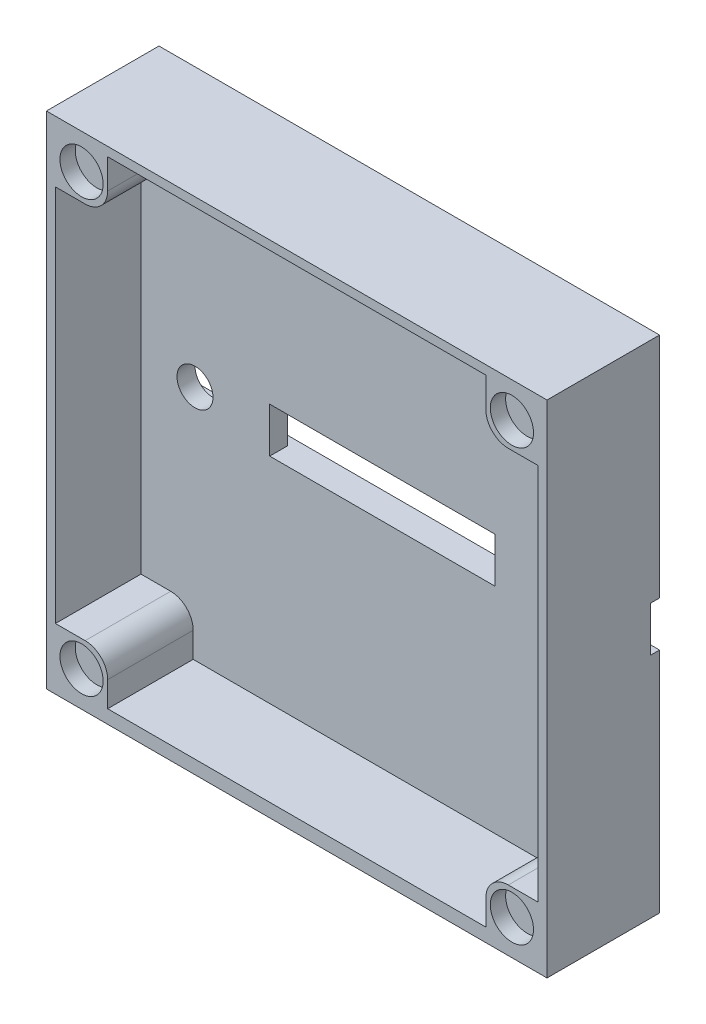
ISO-10303-21;
HEADER;
FILE_DESCRIPTION(('STEP AP214'),'2;1');
FILE_NAME('part.step','',(''),(''),'','','');
FILE_SCHEMA(('AUTOMOTIVE_DESIGN { 1 0 10303 214 1 1 1 1 }'));
ENDSEC;
DATA;
#1=APPLICATION_CONTEXT('core data for automotive mechanical design processes');
#2=APPLICATION_PROTOCOL_DEFINITION('international standard','automotive_design',2000,#1);
#3=PRODUCT_CONTEXT('',#1,'mechanical');
#4=PRODUCT('Part','Part','',(#3));
#5=PRODUCT_RELATED_PRODUCT_CATEGORY('part','',(#4));
#6=PRODUCT_DEFINITION_FORMATION('','',#4);
#7=PRODUCT_DEFINITION_CONTEXT('part definition',#1,'design');
#8=PRODUCT_DEFINITION('design','',#6,#7);
#9=PRODUCT_DEFINITION_SHAPE('','',#8);
#10=(LENGTH_UNIT() NAMED_UNIT(*) SI_UNIT(.MILLI.,.METRE.));
#11=(NAMED_UNIT(*) PLANE_ANGLE_UNIT() SI_UNIT($,.RADIAN.));
#12=(NAMED_UNIT(*) SI_UNIT($,.STERADIAN.) SOLID_ANGLE_UNIT());
#13=UNCERTAINTY_MEASURE_WITH_UNIT(LENGTH_MEASURE(1.E-05),#10,'distance_accuracy_value','');
#14=(GEOMETRIC_REPRESENTATION_CONTEXT(3) GLOBAL_UNCERTAINTY_ASSIGNED_CONTEXT((#13)) GLOBAL_UNIT_ASSIGNED_CONTEXT((#10,
#11,#12)) REPRESENTATION_CONTEXT('',''));
#15=CARTESIAN_POINT('',(0.,0.,0.));
#16=DIRECTION('',(0.,0.,1.));
#17=DIRECTION('',(1.,0.,0.));
#18=AXIS2_PLACEMENT_3D('',#15,#16,#17);
#19=CARTESIAN_POINT('',(0.,0.,3.));
#20=DIRECTION('',(0.,0.,1.));
#21=DIRECTION('',(1.,0.,0.));
#22=AXIS2_PLACEMENT_3D('',#19,#20,#21);
#23=PLANE('',#22);
#24=DIRECTION('',(0.,1.,0.));
#25=VECTOR('',#24,1.);
#26=CARTESIAN_POINT('',(-21.,0.,3.));
#27=LINE('',#26,#25);
#28=CARTESIAN_POINT('',(-21.,-26.3,3.));
#29=VERTEX_POINT('',#28);
#30=CARTESIAN_POINT('',(-21.,-23.5,3.));
#31=VERTEX_POINT('',#30);
#32=EDGE_CURVE('E265',#29,#31,#27,.T.);
#33=ORIENTED_EDGE('',*,*,#32,.F.);
#34=DIRECTION('',(1.,0.,0.));
#35=VECTOR('',#34,1.);
#36=CARTESIAN_POINT('',(-26.8,-26.3,3.));
#37=LINE('',#36,#35);
#38=CARTESIAN_POINT('',(21.,-26.3,3.));
#39=VERTEX_POINT('',#38);
#40=EDGE_CURVE('E279',#29,#39,#37,.T.);
#41=ORIENTED_EDGE('',*,*,#40,.T.);
#42=DIRECTION('',(0.,-1.,0.));
#43=VECTOR('',#42,1.);
#44=CARTESIAN_POINT('',(21.,0.,3.));
#45=LINE('',#44,#43);
#46=CARTESIAN_POINT('',(21.,-23.5,3.));
#47=VERTEX_POINT('',#46);
#48=EDGE_CURVE('E347',#47,#39,#45,.T.);
#49=ORIENTED_EDGE('',*,*,#48,.F.);
#50=CARTESIAN_POINT('',(23.5,-23.5,3.));
#51=DIRECTION('',(0.,0.,1.));
#52=DIRECTION('',(1.,0.,0.));
#53=AXIS2_PLACEMENT_3D('',#50,#51,#52);
#54=CIRCLE('',#53,2.5);
#55=CARTESIAN_POINT('',(23.5,-21.,3.));
#56=VERTEX_POINT('',#55);
#57=EDGE_CURVE('E318',#47,#56,#54,.F.);
#58=ORIENTED_EDGE('',*,*,#57,.T.);
#59=DIRECTION('',(-1.,0.,0.));
#60=VECTOR('',#59,1.);
#61=CARTESIAN_POINT('',(0.,-21.,3.));
#62=LINE('',#61,#60);
#63=CARTESIAN_POINT('',(26.8,-21.,3.));
#64=VERTEX_POINT('',#63);
#65=EDGE_CURVE('E352',#64,#56,#62,.T.);
#66=ORIENTED_EDGE('',*,*,#65,.F.);
#67=DIRECTION('',(0.,-1.,0.));
#68=VECTOR('',#67,1.);
#69=CARTESIAN_POINT('',(26.8,0.,3.));
#70=LINE('',#69,#68);
#71=CARTESIAN_POINT('',(26.8,21.,3.));
#72=VERTEX_POINT('',#71);
#73=EDGE_CURVE('E416',#72,#64,#70,.T.);
#74=ORIENTED_EDGE('',*,*,#73,.F.);
#75=DIRECTION('',(1.,0.,0.));
#76=VECTOR('',#75,1.);
#77=CARTESIAN_POINT('',(0.,21.,3.));
#78=LINE('',#77,#76);
#79=CARTESIAN_POINT('',(23.5,21.,3.));
#80=VERTEX_POINT('',#79);
#81=EDGE_CURVE('E377',#80,#72,#78,.T.);
#82=ORIENTED_EDGE('',*,*,#81,.F.);
#83=CARTESIAN_POINT('',(23.5,23.5,3.));
#84=DIRECTION('',(0.,0.,1.));
#85=DIRECTION('',(1.,0.,0.));
#86=AXIS2_PLACEMENT_3D('',#83,#84,#85);
#87=CIRCLE('',#86,2.5);
#88=CARTESIAN_POINT('',(21.,23.5,3.));
#89=VERTEX_POINT('',#88);
#90=EDGE_CURVE('E316',#80,#89,#87,.F.);
#91=ORIENTED_EDGE('',*,*,#90,.T.);
#92=DIRECTION('',(0.,-1.,0.));
#93=VECTOR('',#92,1.);
#94=CARTESIAN_POINT('',(21.,0.,3.));
#95=LINE('',#94,#93);
#96=CARTESIAN_POINT('',(21.,26.8,3.));
#97=VERTEX_POINT('',#96);
#98=EDGE_CURVE('E382',#97,#89,#95,.T.);
#99=ORIENTED_EDGE('',*,*,#98,.F.);
#100=DIRECTION('',(1.,0.,0.));
#101=VECTOR('',#100,1.);
#102=CARTESIAN_POINT('',(0.,26.8,3.));
#103=LINE('',#102,#101);
#104=CARTESIAN_POINT('',(-21.,26.8,3.));
#105=VERTEX_POINT('',#104);
#106=EDGE_CURVE('E278',#105,#97,#103,.T.);
#107=ORIENTED_EDGE('',*,*,#106,.F.);
#108=DIRECTION('',(0.,1.,0.));
#109=VECTOR('',#108,1.);
#110=CARTESIAN_POINT('',(-21.,0.,3.));
#111=LINE('',#110,#109);
#112=CARTESIAN_POINT('',(-21.,23.5,3.));
#113=VERTEX_POINT('',#112);
#114=EDGE_CURVE('E363',#113,#105,#111,.T.);
#115=ORIENTED_EDGE('',*,*,#114,.F.);
#116=CARTESIAN_POINT('',(-23.5,23.5,3.));
#117=DIRECTION('',(0.,0.,1.));
#118=DIRECTION('',(1.,0.,0.));
#119=AXIS2_PLACEMENT_3D('',#116,#117,#118);
#120=CIRCLE('',#119,2.5);
#121=CARTESIAN_POINT('',(-23.5,21.,3.));
#122=VERTEX_POINT('',#121);
#123=EDGE_CURVE('E12',#113,#122,#120,.F.);
#124=ORIENTED_EDGE('',*,*,#123,.T.);
#125=DIRECTION('',(1.,0.,0.));
#126=VECTOR('',#125,1.);
#127=CARTESIAN_POINT('',(0.,21.,3.));
#128=LINE('',#127,#126);
#129=CARTESIAN_POINT('',(-26.8,21.,3.));
#130=VERTEX_POINT('',#129);
#131=EDGE_CURVE('E367',#130,#122,#128,.T.);
#132=ORIENTED_EDGE('',*,*,#131,.F.);
#133=DIRECTION('',(0.,-1.,0.));
#134=VECTOR('',#133,1.);
#135=CARTESIAN_POINT('',(-26.8,0.,3.));
#136=LINE('',#135,#134);
#137=CARTESIAN_POINT('',(-26.8,-21.,3.));
#138=VERTEX_POINT('',#137);
#139=EDGE_CURVE('E401',#130,#138,#136,.T.);
#140=ORIENTED_EDGE('',*,*,#139,.T.);
#141=DIRECTION('',(-1.,0.,0.));
#142=VECTOR('',#141,1.);
#143=CARTESIAN_POINT('',(0.,-21.,3.));
#144=LINE('',#143,#142);
#145=CARTESIAN_POINT('',(-23.5,-21.,3.));
#146=VERTEX_POINT('',#145);
#147=EDGE_CURVE('E322',#146,#138,#144,.T.);
#148=ORIENTED_EDGE('',*,*,#147,.F.);
#149=CARTESIAN_POINT('',(-23.5,-23.5,3.));
#150=DIRECTION('',(0.,0.,1.));
#151=DIRECTION('',(1.,0.,0.));
#152=AXIS2_PLACEMENT_3D('',#149,#150,#151);
#153=CIRCLE('',#152,2.5);
#154=EDGE_CURVE('E79',#146,#31,#153,.F.);
#155=ORIENTED_EDGE('',*,*,#154,.T.);
#156=EDGE_LOOP('',(#33,#41,#49,#58,#66,#74,#82,#91,#99,#107,#115,#124,#132,#140,#148,#155));
#157=FACE_BOUND('',#156,.T.);
#158=CARTESIAN_POINT('',(20.8,0.,3.));
#159=DIRECTION('',(0.,0.,1.));
#160=DIRECTION('',(1.,0.,0.));
#161=AXIS2_PLACEMENT_3D('',#158,#159,#160);
#162=CIRCLE('',#161,2.);
#163=CARTESIAN_POINT('',(22.8,0.,3.));
#164=VERTEX_POINT('',#163);
#165=EDGE_CURVE('E394',#164,#164,#162,.T.);
#166=ORIENTED_EDGE('',*,*,#165,.F.);
#167=EDGE_LOOP('',(#166));
#168=FACE_BOUND('',#167,.T.);
#169=CARTESIAN_POINT('',(-20.8,0.,3.));
#170=DIRECTION('',(0.,0.,1.));
#171=DIRECTION('',(1.,0.,0.));
#172=AXIS2_PLACEMENT_3D('',#169,#170,#171);
#173=CIRCLE('',#172,2.);
#174=CARTESIAN_POINT('',(-18.8,0.,3.));
#175=VERTEX_POINT('',#174);
#176=EDGE_CURVE('E389',#175,#175,#173,.T.);
#177=ORIENTED_EDGE('',*,*,#176,.F.);
#178=EDGE_LOOP('',(#177));
#179=FACE_BOUND('',#178,.T.);
#180=DIRECTION('',(0.,1.,0.));
#181=VECTOR('',#180,1.);
#182=CARTESIAN_POINT('',(12.5,2.5,3.));
#183=LINE('',#182,#181);
#184=CARTESIAN_POINT('',(12.5,-2.5,3.));
#185=VERTEX_POINT('',#184);
#186=CARTESIAN_POINT('',(12.5,2.5,3.));
#187=VERTEX_POINT('',#186);
#188=EDGE_CURVE('E442',#185,#187,#183,.T.);
#189=ORIENTED_EDGE('',*,*,#188,.F.);
#190=DIRECTION('',(1.,0.,0.));
#191=VECTOR('',#190,1.);
#192=CARTESIAN_POINT('',(-12.5,-2.5,3.));
#193=LINE('',#192,#191);
#194=CARTESIAN_POINT('',(-12.5,-2.5,3.));
#195=VERTEX_POINT('',#194);
#196=EDGE_CURVE('E453',#195,#185,#193,.T.);
#197=ORIENTED_EDGE('',*,*,#196,.F.);
#198=DIRECTION('',(0.,-1.,0.));
#199=VECTOR('',#198,1.);
#200=CARTESIAN_POINT('',(-12.5,2.5,3.));
#201=LINE('',#200,#199);
#202=CARTESIAN_POINT('',(-12.5,2.5,3.));
#203=VERTEX_POINT('',#202);
#204=EDGE_CURVE('E460',#203,#195,#201,.T.);
#205=ORIENTED_EDGE('',*,*,#204,.F.);
#206=DIRECTION('',(-1.,0.,0.));
#207=VECTOR('',#206,1.);
#208=CARTESIAN_POINT('',(-12.5,2.5,3.));
#209=LINE('',#208,#207);
#210=EDGE_CURVE('E457',#187,#203,#209,.T.);
#211=ORIENTED_EDGE('',*,*,#210,.F.);
#212=EDGE_LOOP('',(#189,#197,#205,#211));
#213=FACE_BOUND('',#212,.T.);
#214=ADVANCED_FACE('F71',(#157,#168,#179,#213),#23,.T.);
#215=CARTESIAN_POINT('',(27.8,27.8,3.));
#216=DIRECTION('',(1.,0.,0.));
#217=DIRECTION('',(0.,1.,0.));
#218=AXIS2_PLACEMENT_3D('',#215,#216,#217);
#219=PLANE('',#218);
#220=DIRECTION('',(0.,0.,-1.));
#221=VECTOR('',#220,1.);
#222=CARTESIAN_POINT('',(27.8,27.8,3.));
#223=LINE('',#222,#221);
#224=CARTESIAN_POINT('',(27.8,27.8,12.5));
#225=VERTEX_POINT('',#224);
#226=CARTESIAN_POINT('',(27.8,27.8,0.));
#227=VERTEX_POINT('',#226);
#228=EDGE_CURVE('E486',#225,#227,#223,.T.);
#229=ORIENTED_EDGE('',*,*,#228,.F.);
#230=DIRECTION('',(0.,1.,0.));
#231=VECTOR('',#230,1.);
#232=CARTESIAN_POINT('',(27.8,0.,12.5));
#233=LINE('',#232,#231);
#234=CARTESIAN_POINT('',(27.8,-27.8,12.5));
#235=VERTEX_POINT('',#234);
#236=EDGE_CURVE('E406',#235,#225,#233,.T.);
#237=ORIENTED_EDGE('',*,*,#236,.F.);
#238=DIRECTION('',(0.,0.,-1.));
#239=VECTOR('',#238,1.);
#240=CARTESIAN_POINT('',(27.8,-27.8,3.));
#241=LINE('',#240,#239);
#242=CARTESIAN_POINT('',(27.8,-27.8,0.));
#243=VERTEX_POINT('',#242);
#244=EDGE_CURVE('E290',#235,#243,#241,.T.);
#245=ORIENTED_EDGE('',*,*,#244,.T.);
#246=DIRECTION('',(0.,-1.,0.));
#247=VECTOR('',#246,1.);
#248=CARTESIAN_POINT('',(27.8,27.8,0.));
#249=LINE('',#248,#247);
#250=CARTESIAN_POINT('',(27.8,-2.5,0.));
#251=VERTEX_POINT('',#250);
#252=EDGE_CURVE('E480',#251,#243,#249,.T.);
#253=ORIENTED_EDGE('',*,*,#252,.F.);
#254=DIRECTION('',(0.,0.,-1.));
#255=VECTOR('',#254,1.);
#256=CARTESIAN_POINT('',(27.8,-2.5,1.));
#257=LINE('',#256,#255);
#258=CARTESIAN_POINT('',(27.8,-2.5,1.));
#259=VERTEX_POINT('',#258);
#260=EDGE_CURVE('E435',#259,#251,#257,.T.);
#261=ORIENTED_EDGE('',*,*,#260,.F.);
#262=DIRECTION('',(0.,-1.,0.));
#263=VECTOR('',#262,1.);
#264=CARTESIAN_POINT('',(27.8,2.5,1.));
#265=LINE('',#264,#263);
#266=CARTESIAN_POINT('',(27.8,2.5,1.));
#267=VERTEX_POINT('',#266);
#268=EDGE_CURVE('E421',#267,#259,#265,.T.);
#269=ORIENTED_EDGE('',*,*,#268,.F.);
#270=DIRECTION('',(0.,0.,-1.));
#271=VECTOR('',#270,1.);
#272=CARTESIAN_POINT('',(27.8,2.5,1.));
#273=LINE('',#272,#271);
#274=CARTESIAN_POINT('',(27.8,2.5,0.));
#275=VERTEX_POINT('',#274);
#276=EDGE_CURVE('E439',#267,#275,#273,.T.);
#277=ORIENTED_EDGE('',*,*,#276,.T.);
#278=EDGE_CURVE('E481',#227,#275,#249,.T.);
#279=ORIENTED_EDGE('',*,*,#278,.F.);
#280=EDGE_LOOP('',(#229,#237,#245,#253,#261,#269,#277,#279));
#281=FACE_BOUND('',#280,.T.);
#282=ADVANCED_FACE('F511',(#281),#219,.T.);
#283=CARTESIAN_POINT('',(-27.8,27.8,3.));
#284=DIRECTION('',(1.,0.,0.));
#285=DIRECTION('',(0.,1.,0.));
#286=AXIS2_PLACEMENT_3D('',#283,#284,#285);
#287=PLANE('',#286);
#288=DIRECTION('',(0.,-1.,0.));
#289=VECTOR('',#288,1.);
#290=CARTESIAN_POINT('',(-27.8,27.8,0.));
#291=LINE('',#290,#289);
#292=CARTESIAN_POINT('',(-27.8,-2.5,0.));
#293=VERTEX_POINT('',#292);
#294=CARTESIAN_POINT('',(-27.8,-27.8,0.));
#295=VERTEX_POINT('',#294);
#296=EDGE_CURVE('E475',#293,#295,#291,.T.);
#297=ORIENTED_EDGE('',*,*,#296,.T.);
#298=DIRECTION('',(0.,0.,-1.));
#299=VECTOR('',#298,1.);
#300=CARTESIAN_POINT('',(-27.8,-27.8,3.));
#301=LINE('',#300,#299);
#302=CARTESIAN_POINT('',(-27.8,-27.8,12.5));
#303=VERTEX_POINT('',#302);
#304=EDGE_CURVE('E483',#303,#295,#301,.T.);
#305=ORIENTED_EDGE('',*,*,#304,.F.);
#306=DIRECTION('',(0.,-1.,0.));
#307=VECTOR('',#306,1.);
#308=CARTESIAN_POINT('',(-27.8,0.,12.5));
#309=LINE('',#308,#307);
#310=CARTESIAN_POINT('',(-27.8,27.8,12.5));
#311=VERTEX_POINT('',#310);
#312=EDGE_CURVE('E410',#311,#303,#309,.T.);
#313=ORIENTED_EDGE('',*,*,#312,.F.);
#314=DIRECTION('',(0.,0.,-1.));
#315=VECTOR('',#314,1.);
#316=CARTESIAN_POINT('',(-27.8,27.8,3.));
#317=LINE('',#316,#315);
#318=CARTESIAN_POINT('',(-27.8,27.8,0.));
#319=VERTEX_POINT('',#318);
#320=EDGE_CURVE('E488',#311,#319,#317,.T.);
#321=ORIENTED_EDGE('',*,*,#320,.T.);
#322=CARTESIAN_POINT('',(-27.8,2.5,0.));
#323=VERTEX_POINT('',#322);
#324=EDGE_CURVE('E476',#319,#323,#291,.T.);
#325=ORIENTED_EDGE('',*,*,#324,.T.);
#326=DIRECTION('',(0.,0.,-1.));
#327=VECTOR('',#326,1.);
#328=CARTESIAN_POINT('',(-27.8,2.5,1.));
#329=LINE('',#328,#327);
#330=CARTESIAN_POINT('',(-27.8,2.5,1.));
#331=VERTEX_POINT('',#330);
#332=EDGE_CURVE('E443',#331,#323,#329,.T.);
#333=ORIENTED_EDGE('',*,*,#332,.F.);
#334=DIRECTION('',(0.,-1.,0.));
#335=VECTOR('',#334,1.);
#336=CARTESIAN_POINT('',(-27.8,2.5,1.));
#337=LINE('',#336,#335);
#338=CARTESIAN_POINT('',(-27.8,-2.5,1.));
#339=VERTEX_POINT('',#338);
#340=EDGE_CURVE('E428',#331,#339,#337,.T.);
#341=ORIENTED_EDGE('',*,*,#340,.T.);
#342=DIRECTION('',(0.,0.,-1.));
#343=VECTOR('',#342,1.);
#344=CARTESIAN_POINT('',(-27.8,-2.5,1.));
#345=LINE('',#344,#343);
#346=EDGE_CURVE('E446',#339,#293,#345,.T.);
#347=ORIENTED_EDGE('',*,*,#346,.T.);
#348=EDGE_LOOP('',(#297,#305,#313,#321,#325,#333,#341,#347));
#349=FACE_BOUND('',#348,.T.);
#350=ADVANCED_FACE('F500',(#349),#287,.F.);
#351=CARTESIAN_POINT('',(0.,0.,0.));
#352=DIRECTION('',(0.,0.,1.));
#353=DIRECTION('',(1.,0.,0.));
#354=AXIS2_PLACEMENT_3D('',#351,#352,#353);
#355=PLANE('',#354);
#356=DIRECTION('',(-1.,0.,0.));
#357=VECTOR('',#356,1.);
#358=CARTESIAN_POINT('',(27.8,2.5,0.));
#359=LINE('',#358,#357);
#360=EDGE_CURVE('E425',#275,#323,#359,.T.);
#361=ORIENTED_EDGE('',*,*,#360,.T.);
#362=ORIENTED_EDGE('',*,*,#324,.F.);
#363=DIRECTION('',(-1.,0.,0.));
#364=VECTOR('',#363,1.);
#365=CARTESIAN_POINT('',(27.8,27.8,0.));
#366=LINE('',#365,#364);
#367=EDGE_CURVE('E478',#227,#319,#366,.T.);
#368=ORIENTED_EDGE('',*,*,#367,.F.);
#369=ORIENTED_EDGE('',*,*,#278,.T.);
#370=EDGE_LOOP('',(#361,#362,#368,#369));
#371=FACE_BOUND('',#370,.T.);
#372=ADVANCED_FACE('F521',(#371),#355,.F.);
#373=CARTESIAN_POINT('',(27.8,-27.8,3.));
#374=DIRECTION('',(0.,-1.,0.));
#375=DIRECTION('',(1.,0.,0.));
#376=AXIS2_PLACEMENT_3D('',#373,#374,#375);
#377=PLANE('',#376);
#378=ORIENTED_EDGE('',*,*,#244,.F.);
#379=DIRECTION('',(1.,0.,0.));
#380=VECTOR('',#379,1.);
#381=CARTESIAN_POINT('',(0.,-27.8,12.5));
#382=LINE('',#381,#380);
#383=EDGE_CURVE('E404',#303,#235,#382,.T.);
#384=ORIENTED_EDGE('',*,*,#383,.F.);
#385=ORIENTED_EDGE('',*,*,#304,.T.);
#386=DIRECTION('',(-1.,0.,0.));
#387=VECTOR('',#386,1.);
#388=CARTESIAN_POINT('',(27.8,-27.8,0.));
#389=LINE('',#388,#387);
#390=EDGE_CURVE('E467',#243,#295,#389,.T.);
#391=ORIENTED_EDGE('',*,*,#390,.F.);
#392=EDGE_LOOP('',(#378,#384,#385,#391));
#393=FACE_BOUND('',#392,.T.);
#394=ADVANCED_FACE('F496',(#393),#377,.T.);
#395=CARTESIAN_POINT('',(27.8,27.8,3.));
#396=DIRECTION('',(0.,-1.,0.));
#397=DIRECTION('',(1.,0.,0.));
#398=AXIS2_PLACEMENT_3D('',#395,#396,#397);
#399=PLANE('',#398);
#400=ORIENTED_EDGE('',*,*,#367,.T.);
#401=ORIENTED_EDGE('',*,*,#320,.F.);
#402=DIRECTION('',(-1.,0.,0.));
#403=VECTOR('',#402,1.);
#404=CARTESIAN_POINT('',(0.,27.8,12.5));
#405=LINE('',#404,#403);
#406=EDGE_CURVE('E408',#225,#311,#405,.T.);
#407=ORIENTED_EDGE('',*,*,#406,.F.);
#408=ORIENTED_EDGE('',*,*,#228,.T.);
#409=EDGE_LOOP('',(#400,#401,#407,#408));
#410=FACE_BOUND('',#409,.T.);
#411=ADVANCED_FACE('F516',(#410),#399,.F.);
#412=ORIENTED_EDGE('',*,*,#390,.T.);
#413=ORIENTED_EDGE('',*,*,#296,.F.);
#414=DIRECTION('',(-1.,0.,0.));
#415=VECTOR('',#414,1.);
#416=CARTESIAN_POINT('',(27.8,-2.5,0.));
#417=LINE('',#416,#415);
#418=EDGE_CURVE('E414',#251,#293,#417,.T.);
#419=ORIENTED_EDGE('',*,*,#418,.F.);
#420=ORIENTED_EDGE('',*,*,#252,.T.);
#421=EDGE_LOOP('',(#412,#413,#419,#420));
#422=FACE_BOUND('',#421,.T.);
#423=ADVANCED_FACE('F505',(#422),#355,.F.);
#424=CARTESIAN_POINT('',(12.5,2.5,1.));
#425=DIRECTION('',(1.,0.,0.));
#426=DIRECTION('',(0.,0.,-1.));
#427=AXIS2_PLACEMENT_3D('',#424,#425,#426);
#428=PLANE('',#427);
#429=ORIENTED_EDGE('',*,*,#188,.T.);
#430=DIRECTION('',(0.,0.,1.));
#431=VECTOR('',#430,1.);
#432=CARTESIAN_POINT('',(12.5,2.5,1.));
#433=LINE('',#432,#431);
#434=CARTESIAN_POINT('',(12.5,2.5,1.));
#435=VERTEX_POINT('',#434);
#436=EDGE_CURVE('E455',#435,#187,#433,.T.);
#437=ORIENTED_EDGE('',*,*,#436,.F.);
#438=DIRECTION('',(0.,1.,0.));
#439=VECTOR('',#438,1.);
#440=CARTESIAN_POINT('',(12.5,2.5,1.));
#441=LINE('',#440,#439);
#442=CARTESIAN_POINT('',(12.5,-2.5,1.));
#443=VERTEX_POINT('',#442);
#444=EDGE_CURVE('E450',#443,#435,#441,.T.);
#445=ORIENTED_EDGE('',*,*,#444,.F.);
#446=DIRECTION('',(0.,0.,1.));
#447=VECTOR('',#446,1.);
#448=CARTESIAN_POINT('',(12.5,-2.5,1.));
#449=LINE('',#448,#447);
#450=EDGE_CURVE('E465',#443,#185,#449,.T.);
#451=ORIENTED_EDGE('',*,*,#450,.T.);
#452=EDGE_LOOP('',(#429,#437,#445,#451));
#453=FACE_BOUND('',#452,.T.);
#454=ADVANCED_FACE('F534',(#453),#428,.F.);
#455=CARTESIAN_POINT('',(-12.5,-2.5,1.));
#456=DIRECTION('',(0.,-1.,0.));
#457=DIRECTION('',(0.,0.,-1.));
#458=AXIS2_PLACEMENT_3D('',#455,#456,#457);
#459=PLANE('',#458);
#460=ORIENTED_EDGE('',*,*,#196,.T.);
#461=ORIENTED_EDGE('',*,*,#450,.F.);
#462=DIRECTION('',(-1.,0.,0.));
#463=VECTOR('',#462,1.);
#464=CARTESIAN_POINT('',(27.8,-2.5,1.));
#465=LINE('',#464,#463);
#466=EDGE_CURVE('E426',#259,#443,#465,.T.);
#467=ORIENTED_EDGE('',*,*,#466,.F.);
#468=ORIENTED_EDGE('',*,*,#260,.T.);
#469=ORIENTED_EDGE('',*,*,#418,.T.);
#470=ORIENTED_EDGE('',*,*,#346,.F.);
#471=CARTESIAN_POINT('',(-12.5,-2.5,1.));
#472=VERTEX_POINT('',#471);
#473=EDGE_CURVE('E424',#472,#339,#465,.T.);
#474=ORIENTED_EDGE('',*,*,#473,.F.);
#475=DIRECTION('',(0.,0.,1.));
#476=VECTOR('',#475,1.);
#477=CARTESIAN_POINT('',(-12.5,-2.5,1.));
#478=LINE('',#477,#476);
#479=EDGE_CURVE('E468',#472,#195,#478,.T.);
#480=ORIENTED_EDGE('',*,*,#479,.T.);
#481=EDGE_LOOP('',(#460,#461,#467,#468,#469,#470,#474,#480));
#482=FACE_BOUND('',#481,.T.);
#483=ADVANCED_FACE('F549',(#482),#459,.F.);
#484=CARTESIAN_POINT('',(-12.5,2.5,1.));
#485=DIRECTION('',(-1.,0.,0.));
#486=DIRECTION('',(0.,0.,1.));
#487=AXIS2_PLACEMENT_3D('',#484,#485,#486);
#488=PLANE('',#487);
#489=ORIENTED_EDGE('',*,*,#204,.T.);
#490=ORIENTED_EDGE('',*,*,#479,.F.);
#491=DIRECTION('',(0.,-1.,0.));
#492=VECTOR('',#491,1.);
#493=CARTESIAN_POINT('',(-12.5,2.5,1.));
#494=LINE('',#493,#492);
#495=CARTESIAN_POINT('',(-12.5,2.5,1.));
#496=VERTEX_POINT('',#495);
#497=EDGE_CURVE('E452',#496,#472,#494,.T.);
#498=ORIENTED_EDGE('',*,*,#497,.F.);
#499=DIRECTION('',(0.,0.,1.));
#500=VECTOR('',#499,1.);
#501=CARTESIAN_POINT('',(-12.5,2.5,1.));
#502=LINE('',#501,#500);
#503=EDGE_CURVE('E470',#496,#203,#502,.T.);
#504=ORIENTED_EDGE('',*,*,#503,.T.);
#505=EDGE_LOOP('',(#489,#490,#498,#504));
#506=FACE_BOUND('',#505,.T.);
#507=ADVANCED_FACE('F544',(#506),#488,.F.);
#508=CARTESIAN_POINT('',(-12.5,2.5,1.));
#509=DIRECTION('',(0.,1.,0.));
#510=DIRECTION('',(-1.,0.,0.));
#511=AXIS2_PLACEMENT_3D('',#508,#509,#510);
#512=PLANE('',#511);
#513=ORIENTED_EDGE('',*,*,#210,.T.);
#514=ORIENTED_EDGE('',*,*,#503,.F.);
#515=DIRECTION('',(-1.,0.,0.));
#516=VECTOR('',#515,1.);
#517=CARTESIAN_POINT('',(27.8,2.5,1.));
#518=LINE('',#517,#516);
#519=EDGE_CURVE('E431',#496,#331,#518,.T.);
#520=ORIENTED_EDGE('',*,*,#519,.T.);
#521=ORIENTED_EDGE('',*,*,#332,.T.);
#522=ORIENTED_EDGE('',*,*,#360,.F.);
#523=ORIENTED_EDGE('',*,*,#276,.F.);
#524=EDGE_CURVE('E432',#267,#435,#518,.T.);
#525=ORIENTED_EDGE('',*,*,#524,.T.);
#526=ORIENTED_EDGE('',*,*,#436,.T.);
#527=EDGE_LOOP('',(#513,#514,#520,#521,#522,#523,#525,#526));
#528=FACE_BOUND('',#527,.T.);
#529=ADVANCED_FACE('F524',(#528),#512,.F.);
#530=CARTESIAN_POINT('',(0.,0.,1.));
#531=DIRECTION('',(0.,0.,-1.));
#532=DIRECTION('',(-1.,0.,0.));
#533=AXIS2_PLACEMENT_3D('',#530,#531,#532);
#534=PLANE('',#533);
#535=CARTESIAN_POINT('',(20.8,0.,1.));
#536=DIRECTION('',(0.,0.,-1.));
#537=DIRECTION('',(-1.,0.,0.));
#538=AXIS2_PLACEMENT_3D('',#535,#536,#537);
#539=CIRCLE('',#538,2.);
#540=CARTESIAN_POINT('',(18.8,0.,1.));
#541=VERTEX_POINT('',#540);
#542=EDGE_CURVE('E386',#541,#541,#539,.T.);
#543=ORIENTED_EDGE('',*,*,#542,.F.);
#544=EDGE_LOOP('',(#543));
#545=FACE_BOUND('',#544,.T.);
#546=ORIENTED_EDGE('',*,*,#444,.T.);
#547=ORIENTED_EDGE('',*,*,#524,.F.);
#548=ORIENTED_EDGE('',*,*,#268,.T.);
#549=ORIENTED_EDGE('',*,*,#466,.T.);
#550=EDGE_LOOP('',(#546,#547,#548,#549));
#551=FACE_BOUND('',#550,.T.);
#552=ADVANCED_FACE('F528',(#545,#551),#534,.T.);
#553=CARTESIAN_POINT('',(-20.8,0.,1.));
#554=DIRECTION('',(0.,0.,-1.));
#555=DIRECTION('',(-1.,0.,0.));
#556=AXIS2_PLACEMENT_3D('',#553,#554,#555);
#557=CIRCLE('',#556,2.);
#558=CARTESIAN_POINT('',(-22.8,0.,1.));
#559=VERTEX_POINT('',#558);
#560=EDGE_CURVE('E385',#559,#559,#557,.T.);
#561=ORIENTED_EDGE('',*,*,#560,.F.);
#562=EDGE_LOOP('',(#561));
#563=FACE_BOUND('',#562,.T.);
#564=ORIENTED_EDGE('',*,*,#497,.T.);
#565=ORIENTED_EDGE('',*,*,#473,.T.);
#566=ORIENTED_EDGE('',*,*,#340,.F.);
#567=ORIENTED_EDGE('',*,*,#519,.F.);
#568=EDGE_LOOP('',(#564,#565,#566,#567));
#569=FACE_BOUND('',#568,.T.);
#570=ADVANCED_FACE('F547',(#563,#569),#534,.T.);
#571=CARTESIAN_POINT('',(26.8,0.,12.5));
#572=DIRECTION('',(1.,0.,0.));
#573=DIRECTION('',(0.,1.,0.));
#574=AXIS2_PLACEMENT_3D('',#571,#572,#573);
#575=PLANE('',#574);
#576=ORIENTED_EDGE('',*,*,#73,.T.);
#577=DIRECTION('',(0.,0.,1.));
#578=VECTOR('',#577,1.);
#579=CARTESIAN_POINT('',(26.8,-21.,12.5));
#580=LINE('',#579,#578);
#581=CARTESIAN_POINT('',(26.8,-21.,12.5));
#582=VERTEX_POINT('',#581);
#583=EDGE_CURVE('E349',#64,#582,#580,.T.);
#584=ORIENTED_EDGE('',*,*,#583,.T.);
#585=DIRECTION('',(0.,-1.,0.));
#586=VECTOR('',#585,1.);
#587=CARTESIAN_POINT('',(26.8,0.,12.5));
#588=LINE('',#587,#586);
#589=CARTESIAN_POINT('',(26.8,21.,12.5));
#590=VERTEX_POINT('',#589);
#591=EDGE_CURVE('E400',#590,#582,#588,.T.);
#592=ORIENTED_EDGE('',*,*,#591,.F.);
#593=DIRECTION('',(0.,0.,-1.));
#594=VECTOR('',#593,1.);
#595=CARTESIAN_POINT('',(26.8,21.,12.5));
#596=LINE('',#595,#594);
#597=EDGE_CURVE('E374',#590,#72,#596,.T.);
#598=ORIENTED_EDGE('',*,*,#597,.T.);
#599=EDGE_LOOP('',(#576,#584,#592,#598));
#600=FACE_BOUND('',#599,.T.);
#601=ADVANCED_FACE('F611',(#600),#575,.F.);
#602=CARTESIAN_POINT('',(-26.8,0.,12.5));
#603=DIRECTION('',(1.,0.,0.));
#604=DIRECTION('',(0.,1.,0.));
#605=AXIS2_PLACEMENT_3D('',#602,#603,#604);
#606=PLANE('',#605);
#607=DIRECTION('',(0.,0.,1.));
#608=VECTOR('',#607,1.);
#609=CARTESIAN_POINT('',(-26.8,-21.,12.5));
#610=LINE('',#609,#608);
#611=CARTESIAN_POINT('',(-26.8,-21.,12.5));
#612=VERTEX_POINT('',#611);
#613=EDGE_CURVE('E325',#138,#612,#610,.T.);
#614=ORIENTED_EDGE('',*,*,#613,.F.);
#615=ORIENTED_EDGE('',*,*,#139,.F.);
#616=DIRECTION('',(0.,0.,-1.));
#617=VECTOR('',#616,1.);
#618=CARTESIAN_POINT('',(-26.8,21.,12.5));
#619=LINE('',#618,#617);
#620=CARTESIAN_POINT('',(-26.8,21.,12.5));
#621=VERTEX_POINT('',#620);
#622=EDGE_CURVE('E365',#621,#130,#619,.T.);
#623=ORIENTED_EDGE('',*,*,#622,.F.);
#624=DIRECTION('',(0.,-1.,0.));
#625=VECTOR('',#624,1.);
#626=CARTESIAN_POINT('',(-26.8,0.,12.5));
#627=LINE('',#626,#625);
#628=EDGE_CURVE('E412',#621,#612,#627,.T.);
#629=ORIENTED_EDGE('',*,*,#628,.T.);
#630=EDGE_LOOP('',(#614,#615,#623,#629));
#631=FACE_BOUND('',#630,.T.);
#632=ADVANCED_FACE('F654',(#631),#606,.T.);
#633=CARTESIAN_POINT('',(0.,26.8,12.5));
#634=DIRECTION('',(0.,1.,0.));
#635=DIRECTION('',(0.,0.,1.));
#636=AXIS2_PLACEMENT_3D('',#633,#634,#635);
#637=PLANE('',#636);
#638=DIRECTION('',(1.,0.,0.));
#639=VECTOR('',#638,1.);
#640=CARTESIAN_POINT('',(0.,26.8,12.5));
#641=LINE('',#640,#639);
#642=CARTESIAN_POINT('',(-21.,26.8,12.5));
#643=VERTEX_POINT('',#642);
#644=CARTESIAN_POINT('',(21.,26.8,12.5));
#645=VERTEX_POINT('',#644);
#646=EDGE_CURVE('E397',#643,#645,#641,.T.);
#647=ORIENTED_EDGE('',*,*,#646,.F.);
#648=DIRECTION('',(0.,0.,-1.));
#649=VECTOR('',#648,1.);
#650=CARTESIAN_POINT('',(-21.,26.8,12.5));
#651=LINE('',#650,#649);
#652=EDGE_CURVE('E360',#643,#105,#651,.T.);
#653=ORIENTED_EDGE('',*,*,#652,.T.);
#654=ORIENTED_EDGE('',*,*,#106,.T.);
#655=DIRECTION('',(0.,0.,1.));
#656=VECTOR('',#655,1.);
#657=CARTESIAN_POINT('',(21.,26.8,12.5));
#658=LINE('',#657,#656);
#659=EDGE_CURVE('E379',#97,#645,#658,.T.);
#660=ORIENTED_EDGE('',*,*,#659,.T.);
#661=EDGE_LOOP('',(#647,#653,#654,#660));
#662=FACE_BOUND('',#661,.T.);
#663=ADVANCED_FACE('F597',(#662),#637,.F.);
#664=CARTESIAN_POINT('',(0.,0.,12.5));
#665=DIRECTION('',(0.,0.,1.));
#666=DIRECTION('',(1.,0.,0.));
#667=AXIS2_PLACEMENT_3D('',#664,#665,#666);
#668=PLANE('',#667);
#669=CARTESIAN_POINT('',(23.9002805646626,-23.9,12.5));
#670=DIRECTION('',(0.,0.,1.));
#671=DIRECTION('',(1.,0.,0.));
#672=AXIS2_PLACEMENT_3D('',#669,#670,#671);
#673=CIRCLE('',#672,2.4);
#674=CARTESIAN_POINT('',(26.3002805646626,-23.9,12.5));
#675=VERTEX_POINT('',#674);
#676=EDGE_CURVE('E1019',#675,#675,#673,.T.);
#677=ORIENTED_EDGE('',*,*,#676,.F.);
#678=EDGE_LOOP('',(#677));
#679=FACE_BOUND('',#678,.T.);
#680=CARTESIAN_POINT('',(23.9002805646626,23.9,12.5));
#681=DIRECTION('',(0.,0.,1.));
#682=DIRECTION('',(1.,0.,0.));
#683=AXIS2_PLACEMENT_3D('',#680,#681,#682);
#684=CIRCLE('',#683,2.4);
#685=CARTESIAN_POINT('',(26.3002805646626,23.9,12.5));
#686=VERTEX_POINT('',#685);
#687=EDGE_CURVE('E1013',#686,#686,#684,.T.);
#688=ORIENTED_EDGE('',*,*,#687,.F.);
#689=EDGE_LOOP('',(#688));
#690=FACE_BOUND('',#689,.T.);
#691=CARTESIAN_POINT('',(-23.9,23.9,12.5));
#692=DIRECTION('',(0.,0.,1.));
#693=DIRECTION('',(1.,0.,0.));
#694=AXIS2_PLACEMENT_3D('',#691,#692,#693);
#695=CIRCLE('',#694,2.4);
#696=CARTESIAN_POINT('',(-21.5,23.9,12.5));
#697=VERTEX_POINT('',#696);
#698=EDGE_CURVE('E1004',#697,#697,#695,.T.);
#699=ORIENTED_EDGE('',*,*,#698,.F.);
#700=EDGE_LOOP('',(#699));
#701=FACE_BOUND('',#700,.T.);
#702=CARTESIAN_POINT('',(-23.9,-23.9,12.5));
#703=DIRECTION('',(0.,0.,1.));
#704=DIRECTION('',(1.,0.,0.));
#705=AXIS2_PLACEMENT_3D('',#702,#703,#704);
#706=CIRCLE('',#705,2.4);
#707=CARTESIAN_POINT('',(-21.5,-23.9,12.5));
#708=VERTEX_POINT('',#707);
#709=EDGE_CURVE('E338',#708,#708,#706,.T.);
#710=ORIENTED_EDGE('',*,*,#709,.F.);
#711=EDGE_LOOP('',(#710));
#712=FACE_BOUND('',#711,.T.);
#713=DIRECTION('',(0.,1.,0.));
#714=VECTOR('',#713,1.);
#715=CARTESIAN_POINT('',(21.,27.8,12.5));
#716=LINE('',#715,#714);
#717=CARTESIAN_POINT('',(21.,23.5,12.5));
#718=VERTEX_POINT('',#717);
#719=EDGE_CURVE('E372',#718,#645,#716,.T.);
#720=ORIENTED_EDGE('',*,*,#719,.F.);
#721=CARTESIAN_POINT('',(23.5,23.5,12.5));
#722=DIRECTION('',(0.,0.,1.));
#723=DIRECTION('',(1.,0.,0.));
#724=AXIS2_PLACEMENT_3D('',#721,#722,#723);
#725=CIRCLE('',#724,2.5);
#726=CARTESIAN_POINT('',(23.5,21.,12.5));
#727=VERTEX_POINT('',#726);
#728=EDGE_CURVE('E301',#718,#727,#725,.T.);
#729=ORIENTED_EDGE('',*,*,#728,.T.);
#730=DIRECTION('',(-1.,0.,0.));
#731=VECTOR('',#730,1.);
#732=CARTESIAN_POINT('',(27.8,21.,12.5));
#733=LINE('',#732,#731);
#734=EDGE_CURVE('E369',#590,#727,#733,.T.);
#735=ORIENTED_EDGE('',*,*,#734,.F.);
#736=ORIENTED_EDGE('',*,*,#591,.T.);
#737=DIRECTION('',(1.,0.,0.));
#738=VECTOR('',#737,1.);
#739=CARTESIAN_POINT('',(27.8,-21.,12.5));
#740=LINE('',#739,#738);
#741=CARTESIAN_POINT('',(23.5,-21.,12.5));
#742=VERTEX_POINT('',#741);
#743=EDGE_CURVE('E345',#742,#582,#740,.T.);
#744=ORIENTED_EDGE('',*,*,#743,.F.);
#745=CARTESIAN_POINT('',(23.5,-23.5,12.5));
#746=DIRECTION('',(0.,0.,1.));
#747=DIRECTION('',(1.,0.,0.));
#748=AXIS2_PLACEMENT_3D('',#745,#746,#747);
#749=CIRCLE('',#748,2.5);
#750=CARTESIAN_POINT('',(21.,-23.5,12.5));
#751=VERTEX_POINT('',#750);
#752=EDGE_CURVE('E299',#742,#751,#749,.T.);
#753=ORIENTED_EDGE('',*,*,#752,.T.);
#754=DIRECTION('',(0.,1.,0.));
#755=VECTOR('',#754,1.);
#756=CARTESIAN_POINT('',(21.,-27.8,12.5));
#757=LINE('',#756,#755);
#758=CARTESIAN_POINT('',(21.,-26.3,12.5));
#759=VERTEX_POINT('',#758);
#760=EDGE_CURVE('E274',#759,#751,#757,.T.);
#761=ORIENTED_EDGE('',*,*,#760,.F.);
#762=DIRECTION('',(1.,0.,0.));
#763=VECTOR('',#762,1.);
#764=CARTESIAN_POINT('',(-26.8,-26.3,12.5));
#765=LINE('',#764,#763);
#766=CARTESIAN_POINT('',(-21.,-26.3,12.5));
#767=VERTEX_POINT('',#766);
#768=EDGE_CURVE('E269',#767,#759,#765,.T.);
#769=ORIENTED_EDGE('',*,*,#768,.F.);
#770=DIRECTION('',(0.,-1.,0.));
#771=VECTOR('',#770,1.);
#772=CARTESIAN_POINT('',(-21.,-27.8,12.5));
#773=LINE('',#772,#771);
#774=CARTESIAN_POINT('',(-21.,-23.5,12.5));
#775=VERTEX_POINT('',#774);
#776=EDGE_CURVE('E255',#775,#767,#773,.T.);
#777=ORIENTED_EDGE('',*,*,#776,.F.);
#778=CARTESIAN_POINT('',(-23.5,-23.5,12.5));
#779=DIRECTION('',(0.,0.,1.));
#780=DIRECTION('',(1.,0.,0.));
#781=AXIS2_PLACEMENT_3D('',#778,#779,#780);
#782=CIRCLE('',#781,2.5);
#783=CARTESIAN_POINT('',(-23.5,-21.,12.5));
#784=VERTEX_POINT('',#783);
#785=EDGE_CURVE('E297',#775,#784,#782,.T.);
#786=ORIENTED_EDGE('',*,*,#785,.T.);
#787=DIRECTION('',(1.,0.,0.));
#788=VECTOR('',#787,1.);
#789=CARTESIAN_POINT('',(-27.8,-21.,12.5));
#790=LINE('',#789,#788);
#791=EDGE_CURVE('E266',#612,#784,#790,.T.);
#792=ORIENTED_EDGE('',*,*,#791,.F.);
#793=ORIENTED_EDGE('',*,*,#628,.F.);
#794=DIRECTION('',(-1.,0.,0.));
#795=VECTOR('',#794,1.);
#796=CARTESIAN_POINT('',(-27.8,21.,12.5));
#797=LINE('',#796,#795);
#798=CARTESIAN_POINT('',(-23.5,21.,12.5));
#799=VERTEX_POINT('',#798);
#800=EDGE_CURVE('E358',#799,#621,#797,.T.);
#801=ORIENTED_EDGE('',*,*,#800,.F.);
#802=CARTESIAN_POINT('',(-23.5,23.5,12.5));
#803=DIRECTION('',(0.,0.,1.));
#804=DIRECTION('',(1.,0.,0.));
#805=AXIS2_PLACEMENT_3D('',#802,#803,#804);
#806=CIRCLE('',#805,2.5);
#807=CARTESIAN_POINT('',(-21.,23.5,12.5));
#808=VERTEX_POINT('',#807);
#809=EDGE_CURVE('E295',#799,#808,#806,.T.);
#810=ORIENTED_EDGE('',*,*,#809,.T.);
#811=DIRECTION('',(0.,-1.,0.));
#812=VECTOR('',#811,1.);
#813=CARTESIAN_POINT('',(-21.,27.8,12.5));
#814=LINE('',#813,#812);
#815=EDGE_CURVE('E355',#643,#808,#814,.T.);
#816=ORIENTED_EDGE('',*,*,#815,.F.);
#817=ORIENTED_EDGE('',*,*,#646,.T.);
#818=EDGE_LOOP('',(#720,#729,#735,#736,#744,#753,#761,#769,#777,#786,#792,#793,#801,#810,#816,#817));
#819=FACE_BOUND('',#818,.T.);
#820=ORIENTED_EDGE('',*,*,#383,.T.);
#821=ORIENTED_EDGE('',*,*,#236,.T.);
#822=ORIENTED_EDGE('',*,*,#406,.T.);
#823=ORIENTED_EDGE('',*,*,#312,.T.);
#824=EDGE_LOOP('',(#820,#821,#822,#823));
#825=FACE_BOUND('',#824,.T.);
#826=ADVANCED_FACE('F271',(#679,#690,#701,#712,#819,#825),#668,.T.);
#827=CARTESIAN_POINT('',(-26.8,-26.3,12.5));
#828=DIRECTION('',(0.,1.,0.));
#829=DIRECTION('',(0.,0.,1.));
#830=AXIS2_PLACEMENT_3D('',#827,#828,#829);
#831=PLANE('',#830);
#832=DIRECTION('',(0.,0.,-1.));
#833=VECTOR('',#832,1.);
#834=CARTESIAN_POINT('',(-21.,-26.3,12.5));
#835=LINE('',#834,#833);
#836=EDGE_CURVE('E260',#767,#29,#835,.T.);
#837=ORIENTED_EDGE('',*,*,#836,.F.);
#838=ORIENTED_EDGE('',*,*,#768,.T.);
#839=DIRECTION('',(0.,0.,1.));
#840=VECTOR('',#839,1.);
#841=CARTESIAN_POINT('',(21.,-26.3,12.5));
#842=LINE('',#841,#840);
#843=EDGE_CURVE('E285',#39,#759,#842,.T.);
#844=ORIENTED_EDGE('',*,*,#843,.F.);
#845=ORIENTED_EDGE('',*,*,#40,.F.);
#846=EDGE_LOOP('',(#837,#838,#844,#845));
#847=FACE_BOUND('',#846,.T.);
#848=ADVANCED_FACE('F282',(#847),#831,.T.);
#849=CARTESIAN_POINT('',(-20.8,0.,5.));
#850=DIRECTION('',(0.,0.,-1.));
#851=DIRECTION('',(-1.,0.,0.));
#852=AXIS2_PLACEMENT_3D('',#849,#850,#851);
#853=CYLINDRICAL_SURFACE('',#852,2.);
#854=ORIENTED_EDGE('',*,*,#176,.T.);
#855=EDGE_LOOP('',(#854));
#856=FACE_BOUND('',#855,.T.);
#857=ORIENTED_EDGE('',*,*,#560,.T.);
#858=EDGE_LOOP('',(#857));
#859=FACE_BOUND('',#858,.T.);
#860=ADVANCED_FACE('F646',(#856,#859),#853,.F.);
#861=CARTESIAN_POINT('',(20.8,0.,5.));
#862=DIRECTION('',(0.,0.,-1.));
#863=DIRECTION('',(-1.,0.,0.));
#864=AXIS2_PLACEMENT_3D('',#861,#862,#863);
#865=CYLINDRICAL_SURFACE('',#864,2.);
#866=ORIENTED_EDGE('',*,*,#165,.T.);
#867=EDGE_LOOP('',(#866));
#868=FACE_BOUND('',#867,.T.);
#869=ORIENTED_EDGE('',*,*,#542,.T.);
#870=EDGE_LOOP('',(#869));
#871=FACE_BOUND('',#870,.T.);
#872=ADVANCED_FACE('F641',(#868,#871),#865,.F.);
#873=CARTESIAN_POINT('',(21.,27.8,12.5));
#874=DIRECTION('',(-1.,0.,0.));
#875=DIRECTION('',(0.,0.,1.));
#876=AXIS2_PLACEMENT_3D('',#873,#874,#875);
#877=PLANE('',#876);
#878=ORIENTED_EDGE('',*,*,#98,.T.);
#879=DIRECTION('',(0.,0.,-1.));
#880=VECTOR('',#879,1.);
#881=CARTESIAN_POINT('',(21.,23.5,12.5));
#882=LINE('',#881,#880);
#883=EDGE_CURVE('E288',#89,#718,#882,.F.);
#884=ORIENTED_EDGE('',*,*,#883,.T.);
#885=ORIENTED_EDGE('',*,*,#719,.T.);
#886=ORIENTED_EDGE('',*,*,#659,.F.);
#887=EDGE_LOOP('',(#878,#884,#885,#886));
#888=FACE_BOUND('',#887,.T.);
#889=ADVANCED_FACE('F638',(#888),#877,.T.);
#890=CARTESIAN_POINT('',(27.8,21.,12.5));
#891=DIRECTION('',(0.,-1.,0.));
#892=DIRECTION('',(0.,0.,-1.));
#893=AXIS2_PLACEMENT_3D('',#890,#891,#892);
#894=PLANE('',#893);
#895=ORIENTED_EDGE('',*,*,#734,.T.);
#896=DIRECTION('',(0.,0.,-1.));
#897=VECTOR('',#896,1.);
#898=CARTESIAN_POINT('',(23.5,21.,12.5));
#899=LINE('',#898,#897);
#900=EDGE_CURVE('E284',#727,#80,#899,.T.);
#901=ORIENTED_EDGE('',*,*,#900,.T.);
#902=ORIENTED_EDGE('',*,*,#81,.T.);
#903=ORIENTED_EDGE('',*,*,#597,.F.);
#904=EDGE_LOOP('',(#895,#901,#902,#903));
#905=FACE_BOUND('',#904,.T.);
#906=ADVANCED_FACE('F606',(#905),#894,.T.);
#907=CARTESIAN_POINT('',(-27.8,21.,12.5));
#908=DIRECTION('',(0.,-1.,0.));
#909=DIRECTION('',(0.,0.,-1.));
#910=AXIS2_PLACEMENT_3D('',#907,#908,#909);
#911=PLANE('',#910);
#912=ORIENTED_EDGE('',*,*,#131,.T.);
#913=DIRECTION('',(0.,0.,-1.));
#914=VECTOR('',#913,1.);
#915=CARTESIAN_POINT('',(-23.5,21.,12.5));
#916=LINE('',#915,#914);
#917=EDGE_CURVE('E314',#122,#799,#916,.F.);
#918=ORIENTED_EDGE('',*,*,#917,.T.);
#919=ORIENTED_EDGE('',*,*,#800,.T.);
#920=ORIENTED_EDGE('',*,*,#622,.T.);
#921=EDGE_LOOP('',(#912,#918,#919,#920));
#922=FACE_BOUND('',#921,.T.);
#923=ADVANCED_FACE('F632',(#922),#911,.T.);
#924=CARTESIAN_POINT('',(-21.,27.8,12.5));
#925=DIRECTION('',(1.,0.,0.));
#926=DIRECTION('',(0.,0.,-1.));
#927=AXIS2_PLACEMENT_3D('',#924,#925,#926);
#928=PLANE('',#927);
#929=ORIENTED_EDGE('',*,*,#815,.T.);
#930=DIRECTION('',(0.,0.,-1.));
#931=VECTOR('',#930,1.);
#932=CARTESIAN_POINT('',(-21.,23.5,12.5));
#933=LINE('',#932,#931);
#934=EDGE_CURVE('E312',#808,#113,#933,.T.);
#935=ORIENTED_EDGE('',*,*,#934,.T.);
#936=ORIENTED_EDGE('',*,*,#114,.T.);
#937=ORIENTED_EDGE('',*,*,#652,.F.);
#938=EDGE_LOOP('',(#929,#935,#936,#937));
#939=FACE_BOUND('',#938,.T.);
#940=ADVANCED_FACE('F593',(#939),#928,.T.);
#941=CARTESIAN_POINT('',(27.8,-21.,12.5));
#942=DIRECTION('',(0.,1.,0.));
#943=DIRECTION('',(0.,0.,1.));
#944=AXIS2_PLACEMENT_3D('',#941,#942,#943);
#945=PLANE('',#944);
#946=ORIENTED_EDGE('',*,*,#65,.T.);
#947=DIRECTION('',(0.,0.,-1.));
#948=VECTOR('',#947,1.);
#949=CARTESIAN_POINT('',(23.5,-21.,12.5));
#950=LINE('',#949,#948);
#951=EDGE_CURVE('E306',#56,#742,#950,.F.);
#952=ORIENTED_EDGE('',*,*,#951,.T.);
#953=ORIENTED_EDGE('',*,*,#743,.T.);
#954=ORIENTED_EDGE('',*,*,#583,.F.);
#955=EDGE_LOOP('',(#946,#952,#953,#954));
#956=FACE_BOUND('',#955,.T.);
#957=ADVANCED_FACE('F614',(#956),#945,.T.);
#958=CARTESIAN_POINT('',(21.,-27.8,12.5));
#959=DIRECTION('',(-1.,0.,0.));
#960=DIRECTION('',(0.,0.,1.));
#961=AXIS2_PLACEMENT_3D('',#958,#959,#960);
#962=PLANE('',#961);
#963=ORIENTED_EDGE('',*,*,#760,.T.);
#964=DIRECTION('',(0.,0.,-1.));
#965=VECTOR('',#964,1.);
#966=CARTESIAN_POINT('',(21.,-23.5,12.5));
#967=LINE('',#966,#965);
#968=EDGE_CURVE('E303',#751,#47,#967,.T.);
#969=ORIENTED_EDGE('',*,*,#968,.T.);
#970=ORIENTED_EDGE('',*,*,#48,.T.);
#971=ORIENTED_EDGE('',*,*,#843,.T.);
#972=EDGE_LOOP('',(#963,#969,#970,#971));
#973=FACE_BOUND('',#972,.T.);
#974=ADVANCED_FACE('F621',(#973),#962,.T.);
#975=CARTESIAN_POINT('',(-21.,-27.8,12.5));
#976=DIRECTION('',(1.,0.,0.));
#977=DIRECTION('',(0.,0.,-1.));
#978=AXIS2_PLACEMENT_3D('',#975,#976,#977);
#979=PLANE('',#978);
#980=ORIENTED_EDGE('',*,*,#32,.T.);
#981=DIRECTION('',(0.,0.,-1.));
#982=VECTOR('',#981,1.);
#983=CARTESIAN_POINT('',(-21.,-23.5,12.5));
#984=LINE('',#983,#982);
#985=EDGE_CURVE('E262',#31,#775,#984,.F.);
#986=ORIENTED_EDGE('',*,*,#985,.T.);
#987=ORIENTED_EDGE('',*,*,#776,.T.);
#988=ORIENTED_EDGE('',*,*,#836,.T.);
#989=EDGE_LOOP('',(#980,#986,#987,#988));
#990=FACE_BOUND('',#989,.T.);
#991=ADVANCED_FACE('F258',(#990),#979,.T.);
#992=CARTESIAN_POINT('',(-27.8,-21.,12.5));
#993=DIRECTION('',(0.,1.,0.));
#994=DIRECTION('',(0.,0.,1.));
#995=AXIS2_PLACEMENT_3D('',#992,#993,#994);
#996=PLANE('',#995);
#997=ORIENTED_EDGE('',*,*,#791,.T.);
#998=DIRECTION('',(0.,0.,-1.));
#999=VECTOR('',#998,1.);
#1000=CARTESIAN_POINT('',(-23.5,-21.,12.5));
#1001=LINE('',#1000,#999);
#1002=EDGE_CURVE('E308',#784,#146,#1001,.T.);
#1003=ORIENTED_EDGE('',*,*,#1002,.T.);
#1004=ORIENTED_EDGE('',*,*,#147,.T.);
#1005=ORIENTED_EDGE('',*,*,#613,.T.);
#1006=EDGE_LOOP('',(#997,#1003,#1004,#1005));
#1007=FACE_BOUND('',#1006,.T.);
#1008=ADVANCED_FACE('F333',(#1007),#996,.T.);
#1009=CARTESIAN_POINT('',(-23.9,-23.9,10.8));
#1010=DIRECTION('',(0.,0.,1.));
#1011=DIRECTION('',(1.,0.,0.));
#1012=AXIS2_PLACEMENT_3D('',#1009,#1010,#1011);
#1013=CYLINDRICAL_SURFACE('',#1012,2.4);
#1014=CARTESIAN_POINT('',(-23.9,-23.9,10.8));
#1015=DIRECTION('',(0.,0.,1.));
#1016=DIRECTION('',(1.,0.,0.));
#1017=AXIS2_PLACEMENT_3D('',#1014,#1015,#1016);
#1018=CIRCLE('',#1017,2.4);
#1019=CARTESIAN_POINT('',(-21.5,-23.9,10.8));
#1020=VERTEX_POINT('',#1019);
#1021=EDGE_CURVE('E335',#1020,#1020,#1018,.T.);
#1022=ORIENTED_EDGE('',*,*,#1021,.F.);
#1023=EDGE_LOOP('',(#1022));
#1024=FACE_BOUND('',#1023,.T.);
#1025=ORIENTED_EDGE('',*,*,#709,.T.);
#1026=EDGE_LOOP('',(#1025));
#1027=FACE_BOUND('',#1026,.T.);
#1028=ADVANCED_FACE('F825',(#1024,#1027),#1013,.F.);
#1029=CARTESIAN_POINT('',(-23.9,-23.9,10.8));
#1030=DIRECTION('',(0.,0.,1.));
#1031=DIRECTION('',(1.,0.,0.));
#1032=AXIS2_PLACEMENT_3D('',#1029,#1030,#1031);
#1033=PLANE('',#1032);
#1034=ORIENTED_EDGE('',*,*,#1021,.T.);
#1035=EDGE_LOOP('',(#1034));
#1036=FACE_BOUND('',#1035,.T.);
#1037=ADVANCED_FACE('F889',(#1036),#1033,.T.);
#1038=CARTESIAN_POINT('',(-23.9,23.9,10.8));
#1039=DIRECTION('',(0.,0.,1.));
#1040=DIRECTION('',(1.,0.,0.));
#1041=AXIS2_PLACEMENT_3D('',#1038,#1039,#1040);
#1042=CYLINDRICAL_SURFACE('',#1041,2.4);
#1043=CARTESIAN_POINT('',(-23.9,23.9,10.8));
#1044=DIRECTION('',(0.,0.,1.));
#1045=DIRECTION('',(1.,0.,0.));
#1046=AXIS2_PLACEMENT_3D('',#1043,#1044,#1045);
#1047=CIRCLE('',#1046,2.4);
#1048=CARTESIAN_POINT('',(-21.5,23.9,10.8));
#1049=VERTEX_POINT('',#1048);
#1050=EDGE_CURVE('E1002',#1049,#1049,#1047,.T.);
#1051=ORIENTED_EDGE('',*,*,#1050,.F.);
#1052=EDGE_LOOP('',(#1051));
#1053=FACE_BOUND('',#1052,.T.);
#1054=ORIENTED_EDGE('',*,*,#698,.T.);
#1055=EDGE_LOOP('',(#1054));
#1056=FACE_BOUND('',#1055,.T.);
#1057=ADVANCED_FACE('F881',(#1053,#1056),#1042,.F.);
#1058=CARTESIAN_POINT('',(-23.9,23.9,10.8));
#1059=DIRECTION('',(0.,0.,1.));
#1060=DIRECTION('',(1.,0.,0.));
#1061=AXIS2_PLACEMENT_3D('',#1058,#1059,#1060);
#1062=PLANE('',#1061);
#1063=ORIENTED_EDGE('',*,*,#1050,.T.);
#1064=EDGE_LOOP('',(#1063));
#1065=FACE_BOUND('',#1064,.T.);
#1066=ADVANCED_FACE('F873',(#1065),#1062,.T.);
#1067=CARTESIAN_POINT('',(23.9002805646626,23.9,10.8));
#1068=DIRECTION('',(0.,0.,1.));
#1069=DIRECTION('',(1.,0.,0.));
#1070=AXIS2_PLACEMENT_3D('',#1067,#1068,#1069);
#1071=CYLINDRICAL_SURFACE('',#1070,2.4);
#1072=CARTESIAN_POINT('',(23.9002805646626,23.9,10.8));
#1073=DIRECTION('',(0.,0.,1.));
#1074=DIRECTION('',(1.,0.,0.));
#1075=AXIS2_PLACEMENT_3D('',#1072,#1073,#1074);
#1076=CIRCLE('',#1075,2.4);
#1077=CARTESIAN_POINT('',(26.3002805646626,23.9,10.8));
#1078=VERTEX_POINT('',#1077);
#1079=EDGE_CURVE('E1008',#1078,#1078,#1076,.T.);
#1080=ORIENTED_EDGE('',*,*,#1079,.F.);
#1081=EDGE_LOOP('',(#1080));
#1082=FACE_BOUND('',#1081,.T.);
#1083=ORIENTED_EDGE('',*,*,#687,.T.);
#1084=EDGE_LOOP('',(#1083));
#1085=FACE_BOUND('',#1084,.T.);
#1086=ADVANCED_FACE('F865',(#1082,#1085),#1071,.F.);
#1087=CARTESIAN_POINT('',(23.9002805646626,23.9,10.8));
#1088=DIRECTION('',(0.,0.,1.));
#1089=DIRECTION('',(1.,0.,0.));
#1090=AXIS2_PLACEMENT_3D('',#1087,#1088,#1089);
#1091=PLANE('',#1090);
#1092=ORIENTED_EDGE('',*,*,#1079,.T.);
#1093=EDGE_LOOP('',(#1092));
#1094=FACE_BOUND('',#1093,.T.);
#1095=ADVANCED_FACE('F857',(#1094),#1091,.T.);
#1096=CARTESIAN_POINT('',(23.9002805646626,-23.9,10.8));
#1097=DIRECTION('',(0.,0.,1.));
#1098=DIRECTION('',(1.,0.,0.));
#1099=AXIS2_PLACEMENT_3D('',#1096,#1097,#1098);
#1100=CYLINDRICAL_SURFACE('',#1099,2.4);
#1101=CARTESIAN_POINT('',(23.9002805646626,-23.9,10.8));
#1102=DIRECTION('',(0.,0.,1.));
#1103=DIRECTION('',(1.,0.,0.));
#1104=AXIS2_PLACEMENT_3D('',#1101,#1102,#1103);
#1105=CIRCLE('',#1104,2.4);
#1106=CARTESIAN_POINT('',(26.3002805646626,-23.9,10.8));
#1107=VERTEX_POINT('',#1106);
#1108=EDGE_CURVE('E1016',#1107,#1107,#1105,.T.);
#1109=ORIENTED_EDGE('',*,*,#1108,.F.);
#1110=EDGE_LOOP('',(#1109));
#1111=FACE_BOUND('',#1110,.T.);
#1112=ORIENTED_EDGE('',*,*,#676,.T.);
#1113=EDGE_LOOP('',(#1112));
#1114=FACE_BOUND('',#1113,.T.);
#1115=ADVANCED_FACE('F852',(#1111,#1114),#1100,.F.);
#1116=CARTESIAN_POINT('',(23.9002805646626,-23.9,10.8));
#1117=DIRECTION('',(0.,0.,1.));
#1118=DIRECTION('',(1.,0.,0.));
#1119=AXIS2_PLACEMENT_3D('',#1116,#1117,#1118);
#1120=PLANE('',#1119);
#1121=ORIENTED_EDGE('',*,*,#1108,.T.);
#1122=EDGE_LOOP('',(#1121));
#1123=FACE_BOUND('',#1122,.T.);
#1124=ADVANCED_FACE('F579',(#1123),#1120,.T.);
#1125=CARTESIAN_POINT('',(23.5,23.5,12.5));
#1126=DIRECTION('',(0.,0.,-1.));
#1127=DIRECTION('',(-1.,0.,0.));
#1128=AXIS2_PLACEMENT_3D('',#1125,#1126,#1127);
#1129=CYLINDRICAL_SURFACE('',#1128,2.5);
#1130=ORIENTED_EDGE('',*,*,#728,.F.);
#1131=ORIENTED_EDGE('',*,*,#883,.F.);
#1132=ORIENTED_EDGE('',*,*,#90,.F.);
#1133=ORIENTED_EDGE('',*,*,#900,.F.);
#1134=EDGE_LOOP('',(#1130,#1131,#1132,#1133));
#1135=FACE_BOUND('',#1134,.T.);
#1136=ADVANCED_FACE('F575',(#1135),#1129,.T.);
#1137=CARTESIAN_POINT('',(23.5,-23.5,12.5));
#1138=DIRECTION('',(0.,0.,-1.));
#1139=DIRECTION('',(-1.,0.,0.));
#1140=AXIS2_PLACEMENT_3D('',#1137,#1138,#1139);
#1141=CYLINDRICAL_SURFACE('',#1140,2.5);
#1142=ORIENTED_EDGE('',*,*,#752,.F.);
#1143=ORIENTED_EDGE('',*,*,#951,.F.);
#1144=ORIENTED_EDGE('',*,*,#57,.F.);
#1145=ORIENTED_EDGE('',*,*,#968,.F.);
#1146=EDGE_LOOP('',(#1142,#1143,#1144,#1145));
#1147=FACE_BOUND('',#1146,.T.);
#1148=ADVANCED_FACE('F578',(#1147),#1141,.T.);
#1149=CARTESIAN_POINT('',(-23.5,-23.5,12.5));
#1150=DIRECTION('',(0.,0.,-1.));
#1151=DIRECTION('',(-1.,0.,0.));
#1152=AXIS2_PLACEMENT_3D('',#1149,#1150,#1151);
#1153=CYLINDRICAL_SURFACE('',#1152,2.5);
#1154=ORIENTED_EDGE('',*,*,#785,.F.);
#1155=ORIENTED_EDGE('',*,*,#985,.F.);
#1156=ORIENTED_EDGE('',*,*,#154,.F.);
#1157=ORIENTED_EDGE('',*,*,#1002,.F.);
#1158=EDGE_LOOP('',(#1154,#1155,#1156,#1157));
#1159=FACE_BOUND('',#1158,.T.);
#1160=ADVANCED_FACE('F327',(#1159),#1153,.T.);
#1161=CARTESIAN_POINT('',(-23.5,23.5,12.5));
#1162=DIRECTION('',(0.,0.,-1.));
#1163=DIRECTION('',(-1.,0.,0.));
#1164=AXIS2_PLACEMENT_3D('',#1161,#1162,#1163);
#1165=CYLINDRICAL_SURFACE('',#1164,2.5);
#1166=ORIENTED_EDGE('',*,*,#809,.F.);
#1167=ORIENTED_EDGE('',*,*,#917,.F.);
#1168=ORIENTED_EDGE('',*,*,#123,.F.);
#1169=ORIENTED_EDGE('',*,*,#934,.F.);
#1170=EDGE_LOOP('',(#1166,#1167,#1168,#1169));
#1171=FACE_BOUND('',#1170,.T.);
#1172=ADVANCED_FACE('F73',(#1171),#1165,.T.);
#1173=CLOSED_SHELL('',(#214,#282,#350,#372,#394,#411,#423,#454,#483,#507,#529,#552,#570,#601,
#632,#663,#826,#848,#860,#872,#889,#906,#923,#940,#957,#974,#991,#1008,#1028,#1037,#1057,#1066,
#1086,#1095,#1115,#1124,#1136,#1148,#1160,#1172));
#1174=MANIFOLD_SOLID_BREP('B2',#1173);
#1175=ADVANCED_BREP_SHAPE_REPRESENTATION('',(#18,#1174),#14);
#1176=SHAPE_DEFINITION_REPRESENTATION(#9,#1175);
ENDSEC;
END-ISO-10303-21;
